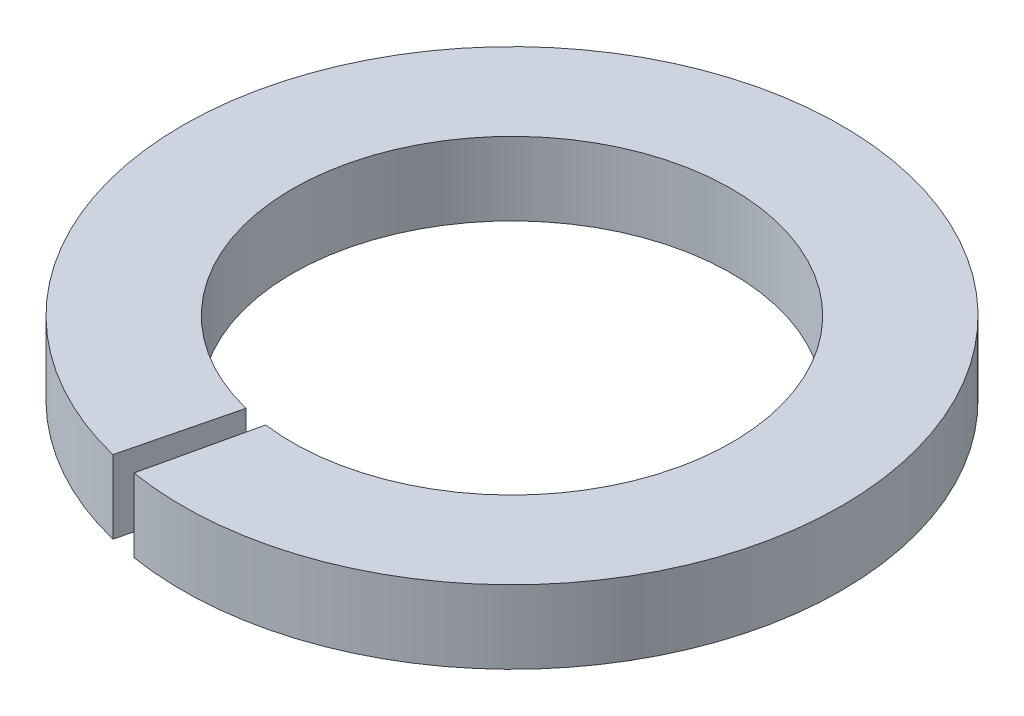
ISO-10303-21;
HEADER;
FILE_DESCRIPTION(('STEP AP214'),'2;1');
FILE_NAME('part.step','',(''),(''),'','','');
FILE_SCHEMA(('AUTOMOTIVE_DESIGN { 1 0 10303 214 1 1 1 1 }'));
ENDSEC;
DATA;
#1=APPLICATION_CONTEXT('core data for automotive mechanical design processes');
#2=APPLICATION_PROTOCOL_DEFINITION('international standard','automotive_design',2000,#1);
#3=PRODUCT_CONTEXT('',#1,'mechanical');
#4=PRODUCT('Part','Part','',(#3));
#5=PRODUCT_RELATED_PRODUCT_CATEGORY('part','',(#4));
#6=PRODUCT_DEFINITION_FORMATION('','',#4);
#7=PRODUCT_DEFINITION_CONTEXT('part definition',#1,'design');
#8=PRODUCT_DEFINITION('design','',#6,#7);
#9=PRODUCT_DEFINITION_SHAPE('','',#8);
#10=(LENGTH_UNIT() NAMED_UNIT(*) SI_UNIT(.MILLI.,.METRE.));
#11=(NAMED_UNIT(*) PLANE_ANGLE_UNIT() SI_UNIT($,.RADIAN.));
#12=(NAMED_UNIT(*) SI_UNIT($,.STERADIAN.) SOLID_ANGLE_UNIT());
#13=UNCERTAINTY_MEASURE_WITH_UNIT(LENGTH_MEASURE(1.E-05),#10,'distance_accuracy_value','');
#14=(GEOMETRIC_REPRESENTATION_CONTEXT(3) GLOBAL_UNCERTAINTY_ASSIGNED_CONTEXT((#13)) GLOBAL_UNIT_ASSIGNED_CONTEXT((#10,
#11,#12)) REPRESENTATION_CONTEXT('',''));
#15=CARTESIAN_POINT('',(0.,0.,0.));
#16=DIRECTION('',(0.,0.,1.));
#17=DIRECTION('',(1.,0.,0.));
#18=AXIS2_PLACEMENT_3D('',#15,#16,#17);
#19=CARTESIAN_POINT('',(0.,1.,0.));
#20=DIRECTION('',(0.,-1.,0.));
#21=DIRECTION('',(0.,0.,-1.));
#22=AXIS2_PLACEMENT_3D('',#19,#20,#21);
#23=CYLINDRICAL_SURFACE('',#22,3.);
#24=CARTESIAN_POINT('',(0.,0.,0.));
#25=DIRECTION('',(0.,-1.,0.));
#26=DIRECTION('',(0.,0.,1.));
#27=AXIS2_PLACEMENT_3D('',#24,#25,#26);
#28=CIRCLE('',#27,3.);
#29=CARTESIAN_POINT('',(-0.721467807867331,0.,2.9119553915215));
#30=VERTEX_POINT('',#29);
#31=CARTESIAN_POINT('',(-0.38969226184759,0.,2.97458231371332));
#32=VERTEX_POINT('',#31);
#33=EDGE_CURVE('E98',#30,#32,#28,.T.);
#34=ORIENTED_EDGE('',*,*,#33,.T.);
#35=DIRECTION('',(0.,-1.,0.));
#36=VECTOR('',#35,1.);
#37=CARTESIAN_POINT('',(-0.38969226184759,1.,2.97458231371332));
#38=LINE('',#37,#36);
#39=CARTESIAN_POINT('',(-0.38969226184759,1.,2.97458231371332));
#40=VERTEX_POINT('',#39);
#41=EDGE_CURVE('E11',#40,#32,#38,.T.);
#42=ORIENTED_EDGE('',*,*,#41,.F.);
#43=CARTESIAN_POINT('',(0.,1.,0.));
#44=DIRECTION('',(0.,-1.,0.));
#45=DIRECTION('',(0.,0.,1.));
#46=AXIS2_PLACEMENT_3D('',#43,#44,#45);
#47=CIRCLE('',#46,3.);
#48=CARTESIAN_POINT('',(-0.721467807867331,1.,2.9119553915215));
#49=VERTEX_POINT('',#48);
#50=EDGE_CURVE('E86',#49,#40,#47,.T.);
#51=ORIENTED_EDGE('',*,*,#50,.F.);
#52=DIRECTION('',(0.,-1.,0.));
#53=VECTOR('',#52,1.);
#54=CARTESIAN_POINT('',(-0.721467807867331,1.,2.9119553915215));
#55=LINE('',#54,#53);
#56=EDGE_CURVE('E94',#49,#30,#55,.T.);
#57=ORIENTED_EDGE('',*,*,#56,.T.);
#58=EDGE_LOOP('',(#34,#42,#51,#57));
#59=FACE_BOUND('',#58,.T.);
#60=ADVANCED_FACE('F35',(#59),#23,.F.);
#61=CARTESIAN_POINT('',(-0.721467807867331,1.,4.44178840133241));
#62=DIRECTION('',(0.975373691603015,0.,0.220558748928048));
#63=DIRECTION('',(0.220558748928048,0.,-0.975373691603016));
#64=AXIS2_PLACEMENT_3D('',#61,#62,#63);
#65=PLANE('',#64);
#66=DIRECTION('',(-0.220558748928048,0.,0.975373691603015));
#67=VECTOR('',#66,1.);
#68=CARTESIAN_POINT('',(-0.721467807867331,0.,4.44178840133241));
#69=LINE('',#68,#67);
#70=CARTESIAN_POINT('',(-0.72146780786733,0.,4.44178840133241));
#71=VERTEX_POINT('',#70);
#72=EDGE_CURVE('E90',#32,#71,#69,.T.);
#73=ORIENTED_EDGE('',*,*,#72,.T.);
#74=DIRECTION('',(0.,-1.,0.));
#75=VECTOR('',#74,1.);
#76=CARTESIAN_POINT('',(-0.72146780786733,1.,4.44178840133241));
#77=LINE('',#76,#75);
#78=CARTESIAN_POINT('',(-0.72146780786733,1.,4.44178840133241));
#79=VERTEX_POINT('',#78);
#80=EDGE_CURVE('E43',#79,#71,#77,.T.);
#81=ORIENTED_EDGE('',*,*,#80,.F.);
#82=DIRECTION('',(-0.220558748928048,0.,0.975373691603015));
#83=VECTOR('',#82,1.);
#84=CARTESIAN_POINT('',(-0.721467807867331,1.,4.44178840133241));
#85=LINE('',#84,#83);
#86=EDGE_CURVE('E81',#40,#79,#85,.T.);
#87=ORIENTED_EDGE('',*,*,#86,.F.);
#88=ORIENTED_EDGE('',*,*,#41,.T.);
#89=EDGE_LOOP('',(#73,#81,#87,#88));
#90=FACE_BOUND('',#89,.T.);
#91=ADVANCED_FACE('F89',(#90),#65,.F.);
#92=CARTESIAN_POINT('',(0.,1.,0.));
#93=DIRECTION('',(0.,-1.,0.));
#94=DIRECTION('',(0.,0.,-1.));
#95=AXIS2_PLACEMENT_3D('',#92,#93,#94);
#96=CYLINDRICAL_SURFACE('',#95,4.5);
#97=CARTESIAN_POINT('',(0.,0.,0.));
#98=DIRECTION('',(0.,1.,0.));
#99=DIRECTION('',(0.,0.,1.));
#100=AXIS2_PLACEMENT_3D('',#97,#98,#99);
#101=CIRCLE('',#100,4.5);
#102=CARTESIAN_POINT('',(-1.082201711801,0.,4.36793308728224));
#103=VERTEX_POINT('',#102);
#104=EDGE_CURVE('E68',#71,#103,#101,.T.);
#105=ORIENTED_EDGE('',*,*,#104,.T.);
#106=DIRECTION('',(0.,-1.,0.));
#107=VECTOR('',#106,1.);
#108=CARTESIAN_POINT('',(-1.082201711801,1.,4.36793308728224));
#109=LINE('',#108,#107);
#110=CARTESIAN_POINT('',(-1.082201711801,1.,4.36793308728224));
#111=VERTEX_POINT('',#110);
#112=EDGE_CURVE('E91',#111,#103,#109,.T.);
#113=ORIENTED_EDGE('',*,*,#112,.F.);
#114=CARTESIAN_POINT('',(0.,1.,0.));
#115=DIRECTION('',(0.,1.,0.));
#116=DIRECTION('',(0.,0.,1.));
#117=AXIS2_PLACEMENT_3D('',#114,#115,#116);
#118=CIRCLE('',#117,4.5);
#119=EDGE_CURVE('E84',#79,#111,#118,.T.);
#120=ORIENTED_EDGE('',*,*,#119,.F.);
#121=ORIENTED_EDGE('',*,*,#80,.T.);
#122=EDGE_LOOP('',(#105,#113,#120,#121));
#123=FACE_BOUND('',#122,.T.);
#124=ADVANCED_FACE('F92',(#123),#96,.T.);
#125=CARTESIAN_POINT('',(-0.721467807867331,1.,2.9119553915215));
#126=DIRECTION('',(-0.970651797173832,0.,-0.240489269289111));
#127=DIRECTION('',(-0.240489269289111,0.,0.970651797173832));
#128=AXIS2_PLACEMENT_3D('',#125,#126,#127);
#129=PLANE('',#128);
#130=DIRECTION('',(0.240489269289111,0.,-0.970651797173832));
#131=VECTOR('',#130,1.);
#132=CARTESIAN_POINT('',(-0.721467807867331,0.,2.9119553915215));
#133=LINE('',#132,#131);
#134=EDGE_CURVE('E74',#103,#30,#133,.T.);
#135=ORIENTED_EDGE('',*,*,#134,.T.);
#136=ORIENTED_EDGE('',*,*,#56,.F.);
#137=DIRECTION('',(0.240489269289111,0.,-0.970651797173832));
#138=VECTOR('',#137,1.);
#139=CARTESIAN_POINT('',(-0.721467807867331,1.,2.9119553915215));
#140=LINE('',#139,#138);
#141=EDGE_CURVE('E51',#111,#49,#140,.T.);
#142=ORIENTED_EDGE('',*,*,#141,.F.);
#143=ORIENTED_EDGE('',*,*,#112,.T.);
#144=EDGE_LOOP('',(#135,#136,#142,#143));
#145=FACE_BOUND('',#144,.T.);
#146=ADVANCED_FACE('F105',(#145),#129,.F.);
#147=CARTESIAN_POINT('',(0.,1.,0.));
#148=DIRECTION('',(0.,1.,0.));
#149=DIRECTION('',(0.,0.,1.));
#150=AXIS2_PLACEMENT_3D('',#147,#148,#149);
#151=PLANE('',#150);
#152=ORIENTED_EDGE('',*,*,#50,.T.);
#153=ORIENTED_EDGE('',*,*,#86,.T.);
#154=ORIENTED_EDGE('',*,*,#119,.T.);
#155=ORIENTED_EDGE('',*,*,#141,.T.);
#156=EDGE_LOOP('',(#152,#153,#154,#155));
#157=FACE_BOUND('',#156,.T.);
#158=ADVANCED_FACE('F82',(#157),#151,.T.);
#159=CARTESIAN_POINT('',(0.,0.,0.));
#160=DIRECTION('',(0.,1.,0.));
#161=DIRECTION('',(0.,0.,1.));
#162=AXIS2_PLACEMENT_3D('',#159,#160,#161);
#163=PLANE('',#162);
#164=ORIENTED_EDGE('',*,*,#33,.F.);
#165=ORIENTED_EDGE('',*,*,#134,.F.);
#166=ORIENTED_EDGE('',*,*,#104,.F.);
#167=ORIENTED_EDGE('',*,*,#72,.F.);
#168=EDGE_LOOP('',(#164,#165,#166,#167));
#169=FACE_BOUND('',#168,.T.);
#170=ADVANCED_FACE('F108',(#169),#163,.F.);
#171=CLOSED_SHELL('',(#60,#91,#124,#146,#158,#170));
#172=MANIFOLD_SOLID_BREP('B2',#171);
#173=ADVANCED_BREP_SHAPE_REPRESENTATION('',(#18,#172),#14);
#174=SHAPE_DEFINITION_REPRESENTATION(#9,#173);
ENDSEC;
END-ISO-10303-21;
